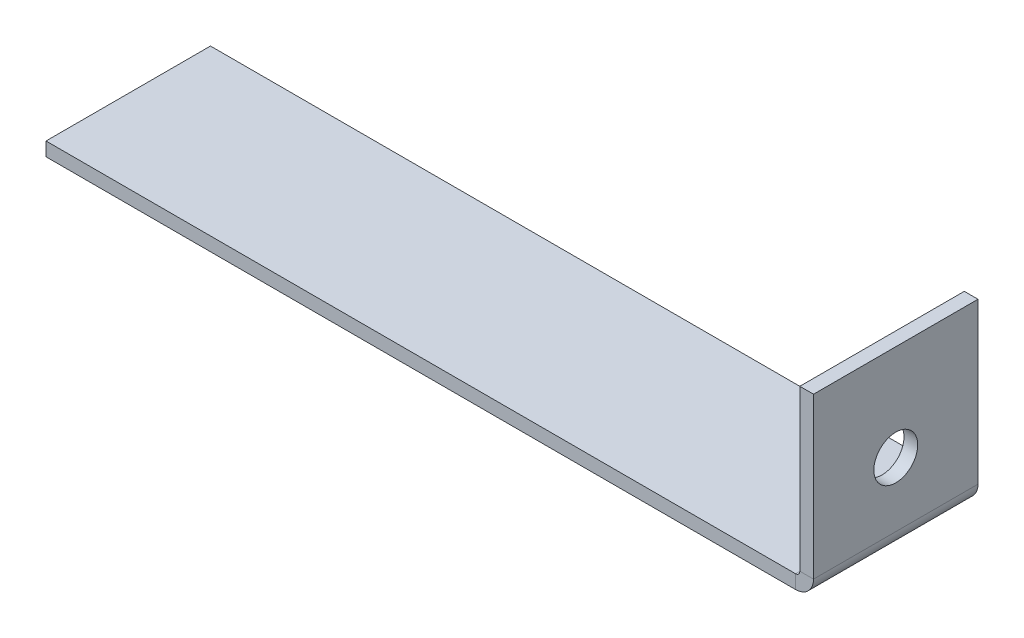
ISO-10303-21;
HEADER;
FILE_DESCRIPTION(('STEP AP214'),'2;1');
FILE_NAME('part.step','',(''),(''),'','','');
FILE_SCHEMA(('AUTOMOTIVE_DESIGN { 1 0 10303 214 1 1 1 1 }'));
ENDSEC;
DATA;
#1=APPLICATION_CONTEXT('core data for automotive mechanical design processes');
#2=APPLICATION_PROTOCOL_DEFINITION('international standard','automotive_design',2000,#1);
#3=PRODUCT_CONTEXT('',#1,'mechanical');
#4=PRODUCT('Part','Part','',(#3));
#5=PRODUCT_RELATED_PRODUCT_CATEGORY('part','',(#4));
#6=PRODUCT_DEFINITION_FORMATION('','',#4);
#7=PRODUCT_DEFINITION_CONTEXT('part definition',#1,'design');
#8=PRODUCT_DEFINITION('design','',#6,#7);
#9=PRODUCT_DEFINITION_SHAPE('','',#8);
#10=(LENGTH_UNIT() NAMED_UNIT(*) SI_UNIT(.MILLI.,.METRE.));
#11=(NAMED_UNIT(*) PLANE_ANGLE_UNIT() SI_UNIT($,.RADIAN.));
#12=(NAMED_UNIT(*) SI_UNIT($,.STERADIAN.) SOLID_ANGLE_UNIT());
#13=UNCERTAINTY_MEASURE_WITH_UNIT(LENGTH_MEASURE(1.E-05),#10,'distance_accuracy_value','');
#14=(GEOMETRIC_REPRESENTATION_CONTEXT(3) GLOBAL_UNCERTAINTY_ASSIGNED_CONTEXT((#13)) GLOBAL_UNIT_ASSIGNED_CONTEXT((#10,
#11,#12)) REPRESENTATION_CONTEXT('',''));
#15=CARTESIAN_POINT('',(0.,0.,0.));
#16=DIRECTION('',(0.,0.,1.));
#17=DIRECTION('',(1.,0.,0.));
#18=AXIS2_PLACEMENT_3D('',#15,#16,#17);
#19=CARTESIAN_POINT('',(0.,-3.175,-38.1));
#20=DIRECTION('',(0.,0.,-1.));
#21=DIRECTION('',(-1.,0.,0.));
#22=AXIS2_PLACEMENT_3D('',#19,#20,#21);
#23=PLANE('',#22);
#24=DIRECTION('',(-1.,0.,0.));
#25=VECTOR('',#24,1.);
#26=CARTESIAN_POINT('',(0.,0.,-38.1));
#27=LINE('',#26,#25);
#28=CARTESIAN_POINT('',(173.625,0.,-38.1));
#29=VERTEX_POINT('',#28);
#30=CARTESIAN_POINT('',(0.,0.,-38.1));
#31=VERTEX_POINT('',#30);
#32=EDGE_CURVE('E99',#29,#31,#27,.T.);
#33=ORIENTED_EDGE('',*,*,#32,.F.);
#34=DIRECTION('',(0.,-1.,0.));
#35=VECTOR('',#34,1.);
#36=CARTESIAN_POINT('',(173.625,0.,-38.1));
#37=LINE('',#36,#35);
#38=CARTESIAN_POINT('',(173.625,-3.175,-38.1));
#39=VERTEX_POINT('',#38);
#40=EDGE_CURVE('E117',#29,#39,#37,.T.);
#41=ORIENTED_EDGE('',*,*,#40,.T.);
#42=DIRECTION('',(-1.,0.,0.));
#43=VECTOR('',#42,1.);
#44=CARTESIAN_POINT('',(0.,-3.175,-38.1));
#45=LINE('',#44,#43);
#46=CARTESIAN_POINT('',(0.,-3.175,-38.1));
#47=VERTEX_POINT('',#46);
#48=EDGE_CURVE('E84',#39,#47,#45,.T.);
#49=ORIENTED_EDGE('',*,*,#48,.T.);
#50=DIRECTION('',(0.,1.,0.));
#51=VECTOR('',#50,1.);
#52=CARTESIAN_POINT('',(0.,-3.175,-38.1));
#53=LINE('',#52,#51);
#54=EDGE_CURVE('E13',#47,#31,#53,.T.);
#55=ORIENTED_EDGE('',*,*,#54,.T.);
#56=EDGE_LOOP('',(#33,#41,#49,#55));
#57=FACE_BOUND('',#56,.T.);
#58=ADVANCED_FACE('F61',(#57),#23,.T.);
#59=CARTESIAN_POINT('',(0.,-3.175,0.));
#60=DIRECTION('',(0.,-1.,0.));
#61=DIRECTION('',(0.,0.,-1.));
#62=AXIS2_PLACEMENT_3D('',#59,#60,#61);
#63=PLANE('',#62);
#64=ORIENTED_EDGE('',*,*,#48,.F.);
#65=DIRECTION('',(0.,0.,-1.));
#66=VECTOR('',#65,1.);
#67=CARTESIAN_POINT('',(173.625,-3.175,-38.1));
#68=LINE('',#67,#66);
#69=CARTESIAN_POINT('',(173.625,-3.175,0.));
#70=VERTEX_POINT('',#69);
#71=EDGE_CURVE('E137',#39,#70,#68,.F.);
#72=ORIENTED_EDGE('',*,*,#71,.T.);
#73=DIRECTION('',(1.,0.,0.));
#74=VECTOR('',#73,1.);
#75=CARTESIAN_POINT('',(0.,-3.175,0.));
#76=LINE('',#75,#74);
#77=CARTESIAN_POINT('',(0.,-3.175,0.));
#78=VERTEX_POINT('',#77);
#79=EDGE_CURVE('E121',#78,#70,#76,.T.);
#80=ORIENTED_EDGE('',*,*,#79,.F.);
#81=DIRECTION('',(0.,0.,1.));
#82=VECTOR('',#81,1.);
#83=CARTESIAN_POINT('',(0.,-3.175,0.));
#84=LINE('',#83,#82);
#85=EDGE_CURVE('E107',#47,#78,#84,.T.);
#86=ORIENTED_EDGE('',*,*,#85,.F.);
#87=EDGE_LOOP('',(#64,#72,#80,#86));
#88=FACE_BOUND('',#87,.T.);
#89=ADVANCED_FACE('F241',(#88),#63,.T.);
#90=CARTESIAN_POINT('',(0.,0.,0.));
#91=DIRECTION('',(0.,-1.,0.));
#92=DIRECTION('',(0.,0.,-1.));
#93=AXIS2_PLACEMENT_3D('',#90,#91,#92);
#94=PLANE('',#93);
#95=DIRECTION('',(0.,0.,-1.));
#96=VECTOR('',#95,1.);
#97=CARTESIAN_POINT('',(173.625,0.,-38.1));
#98=LINE('',#97,#96);
#99=CARTESIAN_POINT('',(173.625,0.,0.));
#100=VERTEX_POINT('',#99);
#101=EDGE_CURVE('E106',#29,#100,#98,.F.);
#102=ORIENTED_EDGE('',*,*,#101,.F.);
#103=ORIENTED_EDGE('',*,*,#32,.T.);
#104=DIRECTION('',(0.,0.,1.));
#105=VECTOR('',#104,1.);
#106=CARTESIAN_POINT('',(0.,0.,0.));
#107=LINE('',#106,#105);
#108=CARTESIAN_POINT('',(0.,0.,0.));
#109=VERTEX_POINT('',#108);
#110=EDGE_CURVE('E103',#31,#109,#107,.T.);
#111=ORIENTED_EDGE('',*,*,#110,.T.);
#112=DIRECTION('',(1.,0.,0.));
#113=VECTOR('',#112,1.);
#114=CARTESIAN_POINT('',(0.,0.,0.));
#115=LINE('',#114,#113);
#116=EDGE_CURVE('E108',#109,#100,#115,.T.);
#117=ORIENTED_EDGE('',*,*,#116,.T.);
#118=EDGE_LOOP('',(#102,#103,#111,#117));
#119=FACE_BOUND('',#118,.T.);
#120=ADVANCED_FACE('F100',(#119),#94,.F.);
#121=CARTESIAN_POINT('',(0.,-3.175,0.));
#122=DIRECTION('',(-1.,0.,0.));
#123=DIRECTION('',(0.,0.,1.));
#124=AXIS2_PLACEMENT_3D('',#121,#122,#123);
#125=PLANE('',#124);
#126=ORIENTED_EDGE('',*,*,#110,.F.);
#127=ORIENTED_EDGE('',*,*,#54,.F.);
#128=ORIENTED_EDGE('',*,*,#85,.T.);
#129=DIRECTION('',(0.,1.,0.));
#130=VECTOR('',#129,1.);
#131=CARTESIAN_POINT('',(0.,-3.175,0.));
#132=LINE('',#131,#130);
#133=EDGE_CURVE('E65',#78,#109,#132,.T.);
#134=ORIENTED_EDGE('',*,*,#133,.T.);
#135=EDGE_LOOP('',(#126,#127,#128,#134));
#136=FACE_BOUND('',#135,.T.);
#137=ADVANCED_FACE('F63',(#136),#125,.T.);
#138=CARTESIAN_POINT('',(0.,-3.175,0.));
#139=DIRECTION('',(0.,0.,1.));
#140=DIRECTION('',(1.,0.,0.));
#141=AXIS2_PLACEMENT_3D('',#138,#139,#140);
#142=PLANE('',#141);
#143=DIRECTION('',(0.,-1.,0.));
#144=VECTOR('',#143,1.);
#145=CARTESIAN_POINT('',(173.625,0.,0.));
#146=LINE('',#145,#144);
#147=EDGE_CURVE('E114',#100,#70,#146,.T.);
#148=ORIENTED_EDGE('',*,*,#147,.F.);
#149=ORIENTED_EDGE('',*,*,#116,.F.);
#150=ORIENTED_EDGE('',*,*,#133,.F.);
#151=ORIENTED_EDGE('',*,*,#79,.T.);
#152=EDGE_LOOP('',(#148,#149,#150,#151));
#153=FACE_BOUND('',#152,.T.);
#154=ADVANCED_FACE('F238',(#153),#142,.T.);
#155=CARTESIAN_POINT('',(173.625,1.,0.));
#156=DIRECTION('',(0.,0.,1.));
#157=DIRECTION('',(1.,0.,0.));
#158=AXIS2_PLACEMENT_3D('',#155,#156,#157);
#159=PLANE('',#158);
#160=DIRECTION('',(-1.,0.,0.));
#161=VECTOR('',#160,1.);
#162=CARTESIAN_POINT('',(177.8,0.999999999999989,0.));
#163=LINE('',#162,#161);
#164=CARTESIAN_POINT('',(174.625,1.,0.));
#165=VERTEX_POINT('',#164);
#166=CARTESIAN_POINT('',(177.8,0.999999999999989,0.));
#167=VERTEX_POINT('',#166);
#168=EDGE_CURVE('E141',#165,#167,#163,.F.);
#169=ORIENTED_EDGE('',*,*,#168,.F.);
#170=CARTESIAN_POINT('',(173.625,1.,0.));
#171=DIRECTION('',(0.,0.,-1.));
#172=DIRECTION('',(-1.,0.,0.));
#173=AXIS2_PLACEMENT_3D('',#170,#171,#172);
#174=CIRCLE('',#173,1.);
#175=EDGE_CURVE('E131',#100,#165,#174,.F.);
#176=ORIENTED_EDGE('',*,*,#175,.F.);
#177=ORIENTED_EDGE('',*,*,#147,.T.);
#178=CARTESIAN_POINT('',(173.625,1.,0.));
#179=DIRECTION('',(0.,0.,-1.));
#180=DIRECTION('',(-1.,0.,0.));
#181=AXIS2_PLACEMENT_3D('',#178,#179,#180);
#182=CIRCLE('',#181,4.175);
#183=EDGE_CURVE('E76',#70,#167,#182,.F.);
#184=ORIENTED_EDGE('',*,*,#183,.T.);
#185=EDGE_LOOP('',(#169,#176,#177,#184));
#186=FACE_BOUND('',#185,.T.);
#187=ADVANCED_FACE('F235',(#186),#159,.T.);
#188=CARTESIAN_POINT('',(173.625,1.,-38.1));
#189=DIRECTION('',(0.,0.,1.));
#190=DIRECTION('',(1.,0.,0.));
#191=AXIS2_PLACEMENT_3D('',#188,#189,#190);
#192=PLANE('',#191);
#193=CARTESIAN_POINT('',(173.625,1.,-38.1));
#194=DIRECTION('',(0.,0.,-1.));
#195=DIRECTION('',(-1.,0.,0.));
#196=AXIS2_PLACEMENT_3D('',#193,#194,#195);
#197=CIRCLE('',#196,1.);
#198=CARTESIAN_POINT('',(174.625,1.,-38.1));
#199=VERTEX_POINT('',#198);
#200=EDGE_CURVE('E126',#199,#29,#197,.T.);
#201=ORIENTED_EDGE('',*,*,#200,.F.);
#202=DIRECTION('',(-1.,0.,0.));
#203=VECTOR('',#202,1.);
#204=CARTESIAN_POINT('',(174.625,1.,-38.1));
#205=LINE('',#204,#203);
#206=CARTESIAN_POINT('',(177.8,0.999999999999989,-38.1));
#207=VERTEX_POINT('',#206);
#208=EDGE_CURVE('E148',#199,#207,#205,.F.);
#209=ORIENTED_EDGE('',*,*,#208,.T.);
#210=CARTESIAN_POINT('',(173.625,1.,-38.1));
#211=DIRECTION('',(0.,0.,-1.));
#212=DIRECTION('',(-1.,0.,0.));
#213=AXIS2_PLACEMENT_3D('',#210,#211,#212);
#214=CIRCLE('',#213,4.175);
#215=EDGE_CURVE('E134',#207,#39,#214,.T.);
#216=ORIENTED_EDGE('',*,*,#215,.T.);
#217=ORIENTED_EDGE('',*,*,#40,.F.);
#218=EDGE_LOOP('',(#201,#209,#216,#217));
#219=FACE_BOUND('',#218,.T.);
#220=ADVANCED_FACE('F230',(#219),#192,.F.);
#221=CARTESIAN_POINT('',(173.625,1.,-38.1));
#222=DIRECTION('',(0.,0.,-1.));
#223=DIRECTION('',(1.,0.,0.));
#224=AXIS2_PLACEMENT_3D('',#221,#222,#223);
#225=CYLINDRICAL_SURFACE('',#224,4.175);
#226=ORIENTED_EDGE('',*,*,#71,.F.);
#227=ORIENTED_EDGE('',*,*,#215,.F.);
#228=DIRECTION('',(0.,0.,-1.));
#229=VECTOR('',#228,1.);
#230=CARTESIAN_POINT('',(177.8,0.999999999999989,0.));
#231=LINE('',#230,#229);
#232=EDGE_CURVE('E151',#207,#167,#231,.F.);
#233=ORIENTED_EDGE('',*,*,#232,.T.);
#234=ORIENTED_EDGE('',*,*,#183,.F.);
#235=EDGE_LOOP('',(#226,#227,#233,#234));
#236=FACE_BOUND('',#235,.T.);
#237=ADVANCED_FACE('F242',(#236),#225,.T.);
#238=CARTESIAN_POINT('',(173.625,1.,-38.1));
#239=DIRECTION('',(0.,0.,-1.));
#240=DIRECTION('',(1.,0.,0.));
#241=AXIS2_PLACEMENT_3D('',#238,#239,#240);
#242=CYLINDRICAL_SURFACE('',#241,1.);
#243=ORIENTED_EDGE('',*,*,#101,.T.);
#244=ORIENTED_EDGE('',*,*,#175,.T.);
#245=DIRECTION('',(0.,0.,-1.));
#246=VECTOR('',#245,1.);
#247=CARTESIAN_POINT('',(174.625,1.,0.));
#248=LINE('',#247,#246);
#249=EDGE_CURVE('E144',#165,#199,#248,.T.);
#250=ORIENTED_EDGE('',*,*,#249,.T.);
#251=ORIENTED_EDGE('',*,*,#200,.T.);
#252=EDGE_LOOP('',(#243,#244,#250,#251));
#253=FACE_BOUND('',#252,.T.);
#254=ADVANCED_FACE('F232',(#253),#242,.F.);
#255=CARTESIAN_POINT('',(177.8,38.1,-38.1));
#256=DIRECTION('',(0.,0.,1.));
#257=DIRECTION('',(1.,0.,0.));
#258=AXIS2_PLACEMENT_3D('',#255,#256,#257);
#259=PLANE('',#258);
#260=ORIENTED_EDGE('',*,*,#208,.F.);
#261=DIRECTION('',(0.,-1.,0.));
#262=VECTOR('',#261,1.);
#263=CARTESIAN_POINT('',(174.625,38.1,-38.1));
#264=LINE('',#263,#262);
#265=CARTESIAN_POINT('',(174.625,38.1,-38.1));
#266=VERTEX_POINT('',#265);
#267=EDGE_CURVE('E153',#199,#266,#264,.F.);
#268=ORIENTED_EDGE('',*,*,#267,.T.);
#269=DIRECTION('',(-1.,0.,0.));
#270=VECTOR('',#269,1.);
#271=CARTESIAN_POINT('',(177.8,38.1,-38.1));
#272=LINE('',#271,#270);
#273=CARTESIAN_POINT('',(177.8,38.1,-38.1));
#274=VERTEX_POINT('',#273);
#275=EDGE_CURVE('E129',#274,#266,#272,.T.);
#276=ORIENTED_EDGE('',*,*,#275,.F.);
#277=DIRECTION('',(0.,1.,0.));
#278=VECTOR('',#277,1.);
#279=CARTESIAN_POINT('',(177.8,-6.58715550948835E-13,-38.1));
#280=LINE('',#279,#278);
#281=EDGE_CURVE('E162',#207,#274,#280,.T.);
#282=ORIENTED_EDGE('',*,*,#281,.F.);
#283=EDGE_LOOP('',(#260,#268,#276,#282));
#284=FACE_BOUND('',#283,.T.);
#285=ADVANCED_FACE('F201',(#284),#259,.F.);
#286=CARTESIAN_POINT('',(177.8,0.,0.));
#287=DIRECTION('',(0.,0.,-1.));
#288=DIRECTION('',(-1.,0.,0.));
#289=AXIS2_PLACEMENT_3D('',#286,#287,#288);
#290=PLANE('',#289);
#291=ORIENTED_EDGE('',*,*,#168,.T.);
#292=DIRECTION('',(0.,-1.,0.));
#293=VECTOR('',#292,1.);
#294=CARTESIAN_POINT('',(177.8,-6.58715550948835E-13,0.));
#295=LINE('',#294,#293);
#296=CARTESIAN_POINT('',(177.8,38.1,0.));
#297=VERTEX_POINT('',#296);
#298=EDGE_CURVE('E168',#297,#167,#295,.T.);
#299=ORIENTED_EDGE('',*,*,#298,.F.);
#300=DIRECTION('',(-1.,0.,0.));
#301=VECTOR('',#300,1.);
#302=CARTESIAN_POINT('',(177.8,38.1,0.));
#303=LINE('',#302,#301);
#304=CARTESIAN_POINT('',(174.625,38.1,0.));
#305=VERTEX_POINT('',#304);
#306=EDGE_CURVE('E171',#297,#305,#303,.T.);
#307=ORIENTED_EDGE('',*,*,#306,.T.);
#308=DIRECTION('',(0.,1.,0.));
#309=VECTOR('',#308,1.);
#310=CARTESIAN_POINT('',(174.625,0.,0.));
#311=LINE('',#310,#309);
#312=EDGE_CURVE('E159',#305,#165,#311,.F.);
#313=ORIENTED_EDGE('',*,*,#312,.T.);
#314=EDGE_LOOP('',(#291,#299,#307,#313));
#315=FACE_BOUND('',#314,.T.);
#316=ADVANCED_FACE('F244',(#315),#290,.F.);
#317=CARTESIAN_POINT('',(177.8,-6.58715550948835E-13,0.));
#318=DIRECTION('',(-1.,0.,0.));
#319=DIRECTION('',(0.,-1.,0.));
#320=AXIS2_PLACEMENT_3D('',#317,#318,#319);
#321=PLANE('',#320);
#322=CARTESIAN_POINT('',(177.8,15.8749999999993,-19.05));
#323=DIRECTION('',(-1.,0.,0.));
#324=DIRECTION('',(0.,-1.,0.));
#325=AXIS2_PLACEMENT_3D('',#322,#323,#324);
#326=CIRCLE('',#325,5.08);
#327=CARTESIAN_POINT('',(177.8,10.7949999999993,-19.05));
#328=VERTEX_POINT('',#327);
#329=EDGE_CURVE('E145',#328,#328,#326,.F.);
#330=ORIENTED_EDGE('',*,*,#329,.F.);
#331=EDGE_LOOP('',(#330));
#332=FACE_BOUND('',#331,.T.);
#333=ORIENTED_EDGE('',*,*,#232,.F.);
#334=ORIENTED_EDGE('',*,*,#281,.T.);
#335=DIRECTION('',(0.,0.,1.));
#336=VECTOR('',#335,1.);
#337=CARTESIAN_POINT('',(177.8,38.1,0.));
#338=LINE('',#337,#336);
#339=EDGE_CURVE('E165',#274,#297,#338,.T.);
#340=ORIENTED_EDGE('',*,*,#339,.T.);
#341=ORIENTED_EDGE('',*,*,#298,.T.);
#342=EDGE_LOOP('',(#333,#334,#340,#341));
#343=FACE_BOUND('',#342,.T.);
#344=ADVANCED_FACE('F189',(#332,#343),#321,.F.);
#345=CARTESIAN_POINT('',(174.625,-6.47630097698008E-13,0.));
#346=DIRECTION('',(-1.,0.,0.));
#347=DIRECTION('',(0.,-1.,0.));
#348=AXIS2_PLACEMENT_3D('',#345,#346,#347);
#349=PLANE('',#348);
#350=CARTESIAN_POINT('',(174.625,15.8749999999993,-19.05));
#351=DIRECTION('',(-1.,0.,0.));
#352=DIRECTION('',(0.,-1.,0.));
#353=AXIS2_PLACEMENT_3D('',#350,#351,#352);
#354=CIRCLE('',#353,5.08);
#355=CARTESIAN_POINT('',(174.625,10.7949999999993,-19.05));
#356=VERTEX_POINT('',#355);
#357=EDGE_CURVE('E178',#356,#356,#354,.T.);
#358=ORIENTED_EDGE('',*,*,#357,.F.);
#359=EDGE_LOOP('',(#358));
#360=FACE_BOUND('',#359,.T.);
#361=ORIENTED_EDGE('',*,*,#267,.F.);
#362=ORIENTED_EDGE('',*,*,#249,.F.);
#363=ORIENTED_EDGE('',*,*,#312,.F.);
#364=DIRECTION('',(0.,0.,-1.));
#365=VECTOR('',#364,1.);
#366=CARTESIAN_POINT('',(174.625,38.1,0.));
#367=LINE('',#366,#365);
#368=EDGE_CURVE('E156',#266,#305,#367,.F.);
#369=ORIENTED_EDGE('',*,*,#368,.F.);
#370=EDGE_LOOP('',(#361,#362,#363,#369));
#371=FACE_BOUND('',#370,.T.);
#372=ADVANCED_FACE('F185',(#360,#371),#349,.T.);
#373=CARTESIAN_POINT('',(177.8,38.1,0.));
#374=DIRECTION('',(0.,-1.,0.));
#375=DIRECTION('',(1.,0.,0.));
#376=AXIS2_PLACEMENT_3D('',#373,#374,#375);
#377=PLANE('',#376);
#378=ORIENTED_EDGE('',*,*,#368,.T.);
#379=ORIENTED_EDGE('',*,*,#306,.F.);
#380=ORIENTED_EDGE('',*,*,#339,.F.);
#381=ORIENTED_EDGE('',*,*,#275,.T.);
#382=EDGE_LOOP('',(#378,#379,#380,#381));
#383=FACE_BOUND('',#382,.T.);
#384=ADVANCED_FACE('F188',(#383),#377,.F.);
#385=CARTESIAN_POINT('',(177.801,15.8749999999993,-19.05));
#386=DIRECTION('',(-1.,0.,0.));
#387=DIRECTION('',(0.,-1.,0.));
#388=AXIS2_PLACEMENT_3D('',#385,#386,#387);
#389=CYLINDRICAL_SURFACE('',#388,5.08);
#390=ORIENTED_EDGE('',*,*,#357,.T.);
#391=EDGE_LOOP('',(#390));
#392=FACE_BOUND('',#391,.T.);
#393=ORIENTED_EDGE('',*,*,#329,.T.);
#394=EDGE_LOOP('',(#393));
#395=FACE_BOUND('',#394,.T.);
#396=ADVANCED_FACE('F182',(#392,#395),#389,.F.);
#397=CLOSED_SHELL('',(#58,#89,#120,#137,#154,#187,#220,#237,#254,#285,#316,#344,#372,#384,#396));
#398=MANIFOLD_SOLID_BREP('B2',#397);
#399=ADVANCED_BREP_SHAPE_REPRESENTATION('',(#18,#398),#14);
#400=SHAPE_DEFINITION_REPRESENTATION(#9,#399);
ENDSEC;
END-ISO-10303-21;
